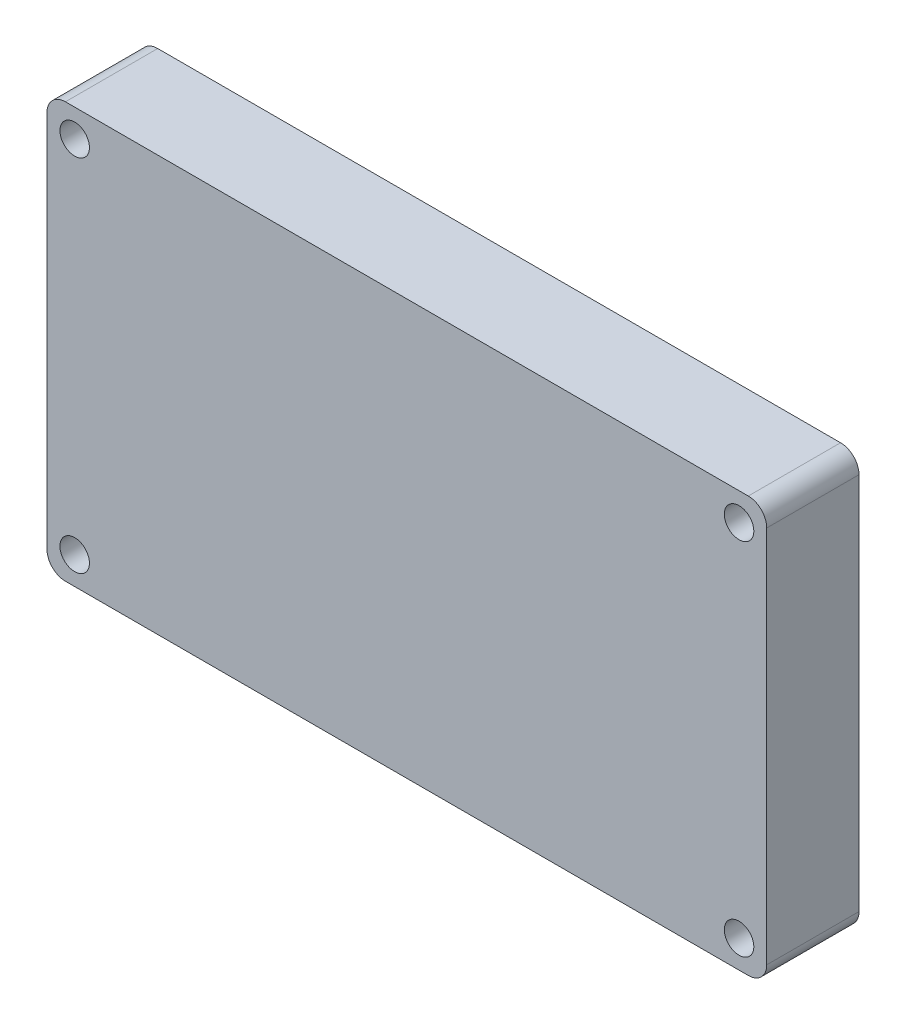
ISO-10303-21;
HEADER;
FILE_DESCRIPTION(('STEP AP214'),'2;1');
FILE_NAME('part.step','',(''),(''),'','','');
FILE_SCHEMA(('AUTOMOTIVE_DESIGN { 1 0 10303 214 1 1 1 1 }'));
ENDSEC;
DATA;
#1=APPLICATION_CONTEXT('core data for automotive mechanical design processes');
#2=APPLICATION_PROTOCOL_DEFINITION('international standard','automotive_design',2000,#1);
#3=PRODUCT_CONTEXT('',#1,'mechanical');
#4=PRODUCT('Part','Part','',(#3));
#5=PRODUCT_RELATED_PRODUCT_CATEGORY('part','',(#4));
#6=PRODUCT_DEFINITION_FORMATION('','',#4);
#7=PRODUCT_DEFINITION_CONTEXT('part definition',#1,'design');
#8=PRODUCT_DEFINITION('design','',#6,#7);
#9=PRODUCT_DEFINITION_SHAPE('','',#8);
#10=(LENGTH_UNIT() NAMED_UNIT(*) SI_UNIT(.MILLI.,.METRE.));
#11=(NAMED_UNIT(*) PLANE_ANGLE_UNIT() SI_UNIT($,.RADIAN.));
#12=(NAMED_UNIT(*) SI_UNIT($,.STERADIAN.) SOLID_ANGLE_UNIT());
#13=UNCERTAINTY_MEASURE_WITH_UNIT(LENGTH_MEASURE(1.E-05),#10,'distance_accuracy_value','');
#14=(GEOMETRIC_REPRESENTATION_CONTEXT(3) GLOBAL_UNCERTAINTY_ASSIGNED_CONTEXT((#13)) GLOBAL_UNIT_ASSIGNED_CONTEXT((#10,
#11,#12)) REPRESENTATION_CONTEXT('',''));
#15=CARTESIAN_POINT('',(0.,0.,0.));
#16=DIRECTION('',(0.,0.,1.));
#17=DIRECTION('',(1.,0.,0.));
#18=AXIS2_PLACEMENT_3D('',#15,#16,#17);
#19=CARTESIAN_POINT('',(-2.,2.,10.));
#20=DIRECTION('',(0.,0.,-1.));
#21=DIRECTION('',(-1.,0.,0.));
#22=AXIS2_PLACEMENT_3D('',#19,#20,#21);
#23=PLANE('',#22);
#24=CARTESIAN_POINT('',(-2.,2.,10.));
#25=DIRECTION('',(0.,0.,1.));
#26=DIRECTION('',(-1.,0.,0.));
#27=AXIS2_PLACEMENT_3D('',#24,#25,#26);
#28=CIRCLE('',#27,2.);
#29=CARTESIAN_POINT('',(-2.00000000000001,0.,10.));
#30=VERTEX_POINT('',#29);
#31=CARTESIAN_POINT('',(0.,2.00000000000001,10.));
#32=VERTEX_POINT('',#31);
#33=EDGE_CURVE('E166',#30,#32,#28,.T.);
#34=ORIENTED_EDGE('',*,*,#33,.T.);
#35=DIRECTION('',(0.,1.,0.));
#36=VECTOR('',#35,1.);
#37=CARTESIAN_POINT('',(0.,2.00000000000001,10.));
#38=LINE('',#37,#36);
#39=CARTESIAN_POINT('',(0.,43.,10.));
#40=VERTEX_POINT('',#39);
#41=EDGE_CURVE('E99',#32,#40,#38,.T.);
#42=ORIENTED_EDGE('',*,*,#41,.T.);
#43=CARTESIAN_POINT('',(-2.,43.,10.));
#44=DIRECTION('',(0.,0.,1.));
#45=DIRECTION('',(-1.,0.,0.));
#46=AXIS2_PLACEMENT_3D('',#43,#44,#45);
#47=CIRCLE('',#46,2.);
#48=CARTESIAN_POINT('',(-2.00000000000001,45.,10.));
#49=VERTEX_POINT('',#48);
#50=EDGE_CURVE('E177',#40,#49,#47,.T.);
#51=ORIENTED_EDGE('',*,*,#50,.T.);
#52=DIRECTION('',(-1.,0.,0.));
#53=VECTOR('',#52,1.);
#54=CARTESIAN_POINT('',(-2.00000000000001,45.,10.));
#55=LINE('',#54,#53);
#56=CARTESIAN_POINT('',(-76.,45.,10.));
#57=VERTEX_POINT('',#56);
#58=EDGE_CURVE('E180',#49,#57,#55,.T.);
#59=ORIENTED_EDGE('',*,*,#58,.T.);
#60=CARTESIAN_POINT('',(-76.,43.,10.));
#61=DIRECTION('',(0.,0.,1.));
#62=DIRECTION('',(1.,0.,0.));
#63=AXIS2_PLACEMENT_3D('',#60,#61,#62);
#64=CIRCLE('',#63,2.);
#65=CARTESIAN_POINT('',(-78.,43.,10.));
#66=VERTEX_POINT('',#65);
#67=EDGE_CURVE('E119',#57,#66,#64,.T.);
#68=ORIENTED_EDGE('',*,*,#67,.T.);
#69=DIRECTION('',(0.,-1.,0.));
#70=VECTOR('',#69,1.);
#71=CARTESIAN_POINT('',(-78.,42.,10.));
#72=LINE('',#71,#70);
#73=CARTESIAN_POINT('',(-78.,2.00000000000001,10.));
#74=VERTEX_POINT('',#73);
#75=EDGE_CURVE('E112',#66,#74,#72,.T.);
#76=ORIENTED_EDGE('',*,*,#75,.T.);
#77=CARTESIAN_POINT('',(-76.,2.,10.));
#78=DIRECTION('',(0.,0.,1.));
#79=DIRECTION('',(-1.,0.,0.));
#80=AXIS2_PLACEMENT_3D('',#77,#78,#79);
#81=CIRCLE('',#80,2.);
#82=CARTESIAN_POINT('',(-76.,0.,10.));
#83=VERTEX_POINT('',#82);
#84=EDGE_CURVE('E116',#74,#83,#81,.T.);
#85=ORIENTED_EDGE('',*,*,#84,.T.);
#86=DIRECTION('',(1.,0.,0.));
#87=VECTOR('',#86,1.);
#88=CARTESIAN_POINT('',(-75.,0.,10.));
#89=LINE('',#88,#87);
#90=EDGE_CURVE('E58',#83,#30,#89,.T.);
#91=ORIENTED_EDGE('',*,*,#90,.T.);
#92=EDGE_LOOP('',(#34,#42,#51,#59,#68,#76,#85,#91));
#93=FACE_BOUND('',#92,.T.);
#94=CARTESIAN_POINT('',(-75.,3.,10.));
#95=DIRECTION('',(0.,0.,1.));
#96=DIRECTION('',(1.,0.,0.));
#97=AXIS2_PLACEMENT_3D('',#94,#95,#96);
#98=CIRCLE('',#97,1.60000000000001);
#99=CARTESIAN_POINT('',(-73.4,3.,10.));
#100=VERTEX_POINT('',#99);
#101=EDGE_CURVE('E153',#100,#100,#98,.T.);
#102=ORIENTED_EDGE('',*,*,#101,.F.);
#103=EDGE_LOOP('',(#102));
#104=FACE_BOUND('',#103,.T.);
#105=CARTESIAN_POINT('',(-3.,3.,10.));
#106=DIRECTION('',(0.,0.,1.));
#107=DIRECTION('',(1.,0.,0.));
#108=AXIS2_PLACEMENT_3D('',#105,#106,#107);
#109=CIRCLE('',#108,1.6);
#110=CARTESIAN_POINT('',(-1.4,3.,10.));
#111=VERTEX_POINT('',#110);
#112=EDGE_CURVE('E165',#111,#111,#109,.T.);
#113=ORIENTED_EDGE('',*,*,#112,.F.);
#114=EDGE_LOOP('',(#113));
#115=FACE_BOUND('',#114,.T.);
#116=CARTESIAN_POINT('',(-3.,42.,10.));
#117=DIRECTION('',(0.,0.,1.));
#118=DIRECTION('',(1.,0.,0.));
#119=AXIS2_PLACEMENT_3D('',#116,#117,#118);
#120=CIRCLE('',#119,1.6);
#121=CARTESIAN_POINT('',(-1.4,42.,10.));
#122=VERTEX_POINT('',#121);
#123=EDGE_CURVE('E214',#122,#122,#120,.T.);
#124=ORIENTED_EDGE('',*,*,#123,.F.);
#125=EDGE_LOOP('',(#124));
#126=FACE_BOUND('',#125,.T.);
#127=CARTESIAN_POINT('',(-75.,42.,10.));
#128=DIRECTION('',(0.,0.,1.));
#129=DIRECTION('',(-1.,0.,0.));
#130=AXIS2_PLACEMENT_3D('',#127,#128,#129);
#131=CIRCLE('',#130,1.60000000000001);
#132=CARTESIAN_POINT('',(-76.6,42.,10.));
#133=VERTEX_POINT('',#132);
#134=EDGE_CURVE('E221',#133,#133,#131,.T.);
#135=ORIENTED_EDGE('',*,*,#134,.F.);
#136=EDGE_LOOP('',(#135));
#137=FACE_BOUND('',#136,.T.);
#138=ADVANCED_FACE('F40',(#93,#104,#115,#126,#137),#23,.F.);
#139=CARTESIAN_POINT('',(-2.,2.,0.));
#140=DIRECTION('',(0.,0.,-1.));
#141=DIRECTION('',(-1.,0.,0.));
#142=AXIS2_PLACEMENT_3D('',#139,#140,#141);
#143=PLANE('',#142);
#144=CARTESIAN_POINT('',(-3.,42.,0.));
#145=DIRECTION('',(0.,0.,1.));
#146=DIRECTION('',(1.,0.,0.));
#147=AXIS2_PLACEMENT_3D('',#144,#145,#146);
#148=CIRCLE('',#147,1.6);
#149=CARTESIAN_POINT('',(-1.4,42.,0.));
#150=VERTEX_POINT('',#149);
#151=EDGE_CURVE('E217',#150,#150,#148,.T.);
#152=ORIENTED_EDGE('',*,*,#151,.T.);
#153=EDGE_LOOP('',(#152));
#154=FACE_BOUND('',#153,.T.);
#155=CARTESIAN_POINT('',(-75.,3.,0.));
#156=DIRECTION('',(0.,0.,1.));
#157=DIRECTION('',(1.,0.,0.));
#158=AXIS2_PLACEMENT_3D('',#155,#156,#157);
#159=CIRCLE('',#158,1.60000000000001);
#160=CARTESIAN_POINT('',(-73.4,3.,0.));
#161=VERTEX_POINT('',#160);
#162=EDGE_CURVE('E160',#161,#161,#159,.T.);
#163=ORIENTED_EDGE('',*,*,#162,.T.);
#164=EDGE_LOOP('',(#163));
#165=FACE_BOUND('',#164,.T.);
#166=CARTESIAN_POINT('',(-2.,2.,0.));
#167=DIRECTION('',(0.,0.,1.));
#168=DIRECTION('',(-1.,0.,0.));
#169=AXIS2_PLACEMENT_3D('',#166,#167,#168);
#170=CIRCLE('',#169,2.);
#171=CARTESIAN_POINT('',(-2.00000000000001,0.,0.));
#172=VERTEX_POINT('',#171);
#173=CARTESIAN_POINT('',(0.,2.00000000000001,0.));
#174=VERTEX_POINT('',#173);
#175=EDGE_CURVE('E159',#172,#174,#170,.T.);
#176=ORIENTED_EDGE('',*,*,#175,.F.);
#177=DIRECTION('',(1.,0.,0.));
#178=VECTOR('',#177,1.);
#179=CARTESIAN_POINT('',(-3.00000000000002,0.,0.));
#180=LINE('',#179,#178);
#181=CARTESIAN_POINT('',(-76.,0.,0.));
#182=VERTEX_POINT('',#181);
#183=EDGE_CURVE('E87',#182,#172,#180,.T.);
#184=ORIENTED_EDGE('',*,*,#183,.F.);
#185=CARTESIAN_POINT('',(-76.,2.,0.));
#186=DIRECTION('',(0.,0.,1.));
#187=DIRECTION('',(-1.,0.,0.));
#188=AXIS2_PLACEMENT_3D('',#185,#186,#187);
#189=CIRCLE('',#188,2.);
#190=CARTESIAN_POINT('',(-78.,2.00000000000001,0.));
#191=VERTEX_POINT('',#190);
#192=EDGE_CURVE('E188',#191,#182,#189,.T.);
#193=ORIENTED_EDGE('',*,*,#192,.F.);
#194=DIRECTION('',(0.,-1.,0.));
#195=VECTOR('',#194,1.);
#196=CARTESIAN_POINT('',(-78.,2.00000000000001,0.));
#197=LINE('',#196,#195);
#198=CARTESIAN_POINT('',(-78.,43.,0.));
#199=VERTEX_POINT('',#198);
#200=EDGE_CURVE('E128',#199,#191,#197,.T.);
#201=ORIENTED_EDGE('',*,*,#200,.F.);
#202=CARTESIAN_POINT('',(-76.,43.,0.));
#203=DIRECTION('',(0.,0.,1.));
#204=DIRECTION('',(1.,0.,0.));
#205=AXIS2_PLACEMENT_3D('',#202,#203,#204);
#206=CIRCLE('',#205,2.);
#207=CARTESIAN_POINT('',(-76.,45.,0.));
#208=VERTEX_POINT('',#207);
#209=EDGE_CURVE('E193',#208,#199,#206,.T.);
#210=ORIENTED_EDGE('',*,*,#209,.F.);
#211=DIRECTION('',(-1.,0.,0.));
#212=VECTOR('',#211,1.);
#213=CARTESIAN_POINT('',(-76.,45.,0.));
#214=LINE('',#213,#212);
#215=CARTESIAN_POINT('',(-2.00000000000001,45.,0.));
#216=VERTEX_POINT('',#215);
#217=EDGE_CURVE('E197',#216,#208,#214,.T.);
#218=ORIENTED_EDGE('',*,*,#217,.F.);
#219=CARTESIAN_POINT('',(-2.,43.,0.));
#220=DIRECTION('',(0.,0.,1.));
#221=DIRECTION('',(-1.,0.,0.));
#222=AXIS2_PLACEMENT_3D('',#219,#220,#221);
#223=CIRCLE('',#222,2.);
#224=CARTESIAN_POINT('',(0.,43.,0.));
#225=VERTEX_POINT('',#224);
#226=EDGE_CURVE('E200',#225,#216,#223,.T.);
#227=ORIENTED_EDGE('',*,*,#226,.F.);
#228=DIRECTION('',(0.,1.,0.));
#229=VECTOR('',#228,1.);
#230=CARTESIAN_POINT('',(0.,42.,0.));
#231=LINE('',#230,#229);
#232=EDGE_CURVE('E204',#174,#225,#231,.T.);
#233=ORIENTED_EDGE('',*,*,#232,.F.);
#234=EDGE_LOOP('',(#176,#184,#193,#201,#210,#218,#227,#233));
#235=FACE_BOUND('',#234,.T.);
#236=CARTESIAN_POINT('',(-3.,3.,0.));
#237=DIRECTION('',(0.,0.,1.));
#238=DIRECTION('',(1.,0.,0.));
#239=AXIS2_PLACEMENT_3D('',#236,#237,#238);
#240=CIRCLE('',#239,1.6);
#241=CARTESIAN_POINT('',(-1.4,3.,0.));
#242=VERTEX_POINT('',#241);
#243=EDGE_CURVE('E161',#242,#242,#240,.T.);
#244=ORIENTED_EDGE('',*,*,#243,.T.);
#245=EDGE_LOOP('',(#244));
#246=FACE_BOUND('',#245,.T.);
#247=CARTESIAN_POINT('',(-75.,42.,0.));
#248=DIRECTION('',(0.,0.,1.));
#249=DIRECTION('',(-1.,0.,0.));
#250=AXIS2_PLACEMENT_3D('',#247,#248,#249);
#251=CIRCLE('',#250,1.60000000000001);
#252=CARTESIAN_POINT('',(-76.6,42.,0.));
#253=VERTEX_POINT('',#252);
#254=EDGE_CURVE('E225',#253,#253,#251,.T.);
#255=ORIENTED_EDGE('',*,*,#254,.T.);
#256=EDGE_LOOP('',(#255));
#257=FACE_BOUND('',#256,.T.);
#258=ADVANCED_FACE('F233',(#154,#165,#235,#246,#257),#143,.T.);
#259=CARTESIAN_POINT('',(-2.,2.,10.));
#260=DIRECTION('',(0.,0.,-1.));
#261=DIRECTION('',(-1.,0.,0.));
#262=AXIS2_PLACEMENT_3D('',#259,#260,#261);
#263=CYLINDRICAL_SURFACE('',#262,2.);
#264=ORIENTED_EDGE('',*,*,#175,.T.);
#265=DIRECTION('',(0.,0.,-1.));
#266=VECTOR('',#265,1.);
#267=CARTESIAN_POINT('',(0.,2.00000000000001,10.));
#268=LINE('',#267,#266);
#269=EDGE_CURVE('E12',#32,#174,#268,.T.);
#270=ORIENTED_EDGE('',*,*,#269,.F.);
#271=ORIENTED_EDGE('',*,*,#33,.F.);
#272=DIRECTION('',(0.,0.,-1.));
#273=VECTOR('',#272,1.);
#274=CARTESIAN_POINT('',(-2.00000000000001,0.,10.));
#275=LINE('',#274,#273);
#276=EDGE_CURVE('E138',#30,#172,#275,.T.);
#277=ORIENTED_EDGE('',*,*,#276,.T.);
#278=EDGE_LOOP('',(#264,#270,#271,#277));
#279=FACE_BOUND('',#278,.T.);
#280=ADVANCED_FACE('F42',(#279),#263,.T.);
#281=CARTESIAN_POINT('',(0.,42.,10.));
#282=DIRECTION('',(-1.,0.,0.));
#283=DIRECTION('',(0.,-1.,0.));
#284=AXIS2_PLACEMENT_3D('',#281,#282,#283);
#285=PLANE('',#284);
#286=ORIENTED_EDGE('',*,*,#232,.T.);
#287=DIRECTION('',(0.,0.,-1.));
#288=VECTOR('',#287,1.);
#289=CARTESIAN_POINT('',(0.,43.,10.));
#290=LINE('',#289,#288);
#291=EDGE_CURVE('E50',#40,#225,#290,.T.);
#292=ORIENTED_EDGE('',*,*,#291,.F.);
#293=ORIENTED_EDGE('',*,*,#41,.F.);
#294=ORIENTED_EDGE('',*,*,#269,.T.);
#295=EDGE_LOOP('',(#286,#292,#293,#294));
#296=FACE_BOUND('',#295,.T.);
#297=ADVANCED_FACE('F274',(#296),#285,.F.);
#298=CARTESIAN_POINT('',(-2.,43.,10.));
#299=DIRECTION('',(0.,0.,-1.));
#300=DIRECTION('',(-1.,0.,0.));
#301=AXIS2_PLACEMENT_3D('',#298,#299,#300);
#302=CYLINDRICAL_SURFACE('',#301,2.);
#303=ORIENTED_EDGE('',*,*,#226,.T.);
#304=DIRECTION('',(0.,0.,-1.));
#305=VECTOR('',#304,1.);
#306=CARTESIAN_POINT('',(-2.00000000000001,45.,10.));
#307=LINE('',#306,#305);
#308=EDGE_CURVE('E288',#49,#216,#307,.T.);
#309=ORIENTED_EDGE('',*,*,#308,.F.);
#310=ORIENTED_EDGE('',*,*,#50,.F.);
#311=ORIENTED_EDGE('',*,*,#291,.T.);
#312=EDGE_LOOP('',(#303,#309,#310,#311));
#313=FACE_BOUND('',#312,.T.);
#314=ADVANCED_FACE('F271',(#313),#302,.T.);
#315=CARTESIAN_POINT('',(-76.,45.,10.));
#316=DIRECTION('',(0.,-1.,0.));
#317=DIRECTION('',(0.,0.,-1.));
#318=AXIS2_PLACEMENT_3D('',#315,#316,#317);
#319=PLANE('',#318);
#320=ORIENTED_EDGE('',*,*,#217,.T.);
#321=DIRECTION('',(0.,0.,-1.));
#322=VECTOR('',#321,1.);
#323=CARTESIAN_POINT('',(-76.,45.,10.));
#324=LINE('',#323,#322);
#325=EDGE_CURVE('E294',#57,#208,#324,.T.);
#326=ORIENTED_EDGE('',*,*,#325,.F.);
#327=ORIENTED_EDGE('',*,*,#58,.F.);
#328=ORIENTED_EDGE('',*,*,#308,.T.);
#329=EDGE_LOOP('',(#320,#326,#327,#328));
#330=FACE_BOUND('',#329,.T.);
#331=ADVANCED_FACE('F267',(#330),#319,.F.);
#332=CARTESIAN_POINT('',(-76.,43.,10.));
#333=DIRECTION('',(0.,0.,-1.));
#334=DIRECTION('',(-1.,0.,0.));
#335=AXIS2_PLACEMENT_3D('',#332,#333,#334);
#336=CYLINDRICAL_SURFACE('',#335,2.);
#337=ORIENTED_EDGE('',*,*,#209,.T.);
#338=DIRECTION('',(0.,0.,-1.));
#339=VECTOR('',#338,1.);
#340=CARTESIAN_POINT('',(-78.,43.,10.));
#341=LINE('',#340,#339);
#342=EDGE_CURVE('E131',#66,#199,#341,.T.);
#343=ORIENTED_EDGE('',*,*,#342,.F.);
#344=ORIENTED_EDGE('',*,*,#67,.F.);
#345=ORIENTED_EDGE('',*,*,#325,.T.);
#346=EDGE_LOOP('',(#337,#343,#344,#345));
#347=FACE_BOUND('',#346,.T.);
#348=ADVANCED_FACE('F264',(#347),#336,.T.);
#349=CARTESIAN_POINT('',(-78.,2.00000000000001,10.));
#350=DIRECTION('',(1.,0.,0.));
#351=DIRECTION('',(0.,0.,-1.));
#352=AXIS2_PLACEMENT_3D('',#349,#350,#351);
#353=PLANE('',#352);
#354=ORIENTED_EDGE('',*,*,#200,.T.);
#355=DIRECTION('',(0.,0.,-1.));
#356=VECTOR('',#355,1.);
#357=CARTESIAN_POINT('',(-78.,2.00000000000001,10.));
#358=LINE('',#357,#356);
#359=EDGE_CURVE('E126',#74,#191,#358,.T.);
#360=ORIENTED_EDGE('',*,*,#359,.F.);
#361=ORIENTED_EDGE('',*,*,#75,.F.);
#362=ORIENTED_EDGE('',*,*,#342,.T.);
#363=EDGE_LOOP('',(#354,#360,#361,#362));
#364=FACE_BOUND('',#363,.T.);
#365=ADVANCED_FACE('F127',(#364),#353,.F.);
#366=CARTESIAN_POINT('',(-76.,2.,10.));
#367=DIRECTION('',(0.,0.,-1.));
#368=DIRECTION('',(-1.,0.,0.));
#369=AXIS2_PLACEMENT_3D('',#366,#367,#368);
#370=CYLINDRICAL_SURFACE('',#369,2.);
#371=ORIENTED_EDGE('',*,*,#192,.T.);
#372=DIRECTION('',(0.,0.,-1.));
#373=VECTOR('',#372,1.);
#374=CARTESIAN_POINT('',(-76.,0.,10.));
#375=LINE('',#374,#373);
#376=EDGE_CURVE('E132',#83,#182,#375,.T.);
#377=ORIENTED_EDGE('',*,*,#376,.F.);
#378=ORIENTED_EDGE('',*,*,#84,.F.);
#379=ORIENTED_EDGE('',*,*,#359,.T.);
#380=EDGE_LOOP('',(#371,#377,#378,#379));
#381=FACE_BOUND('',#380,.T.);
#382=ADVANCED_FACE('F134',(#381),#370,.T.);
#383=CARTESIAN_POINT('',(-3.00000000000002,0.,10.));
#384=DIRECTION('',(0.,1.,0.));
#385=DIRECTION('',(0.,0.,1.));
#386=AXIS2_PLACEMENT_3D('',#383,#384,#385);
#387=PLANE('',#386);
#388=ORIENTED_EDGE('',*,*,#183,.T.);
#389=ORIENTED_EDGE('',*,*,#276,.F.);
#390=ORIENTED_EDGE('',*,*,#90,.F.);
#391=ORIENTED_EDGE('',*,*,#376,.T.);
#392=EDGE_LOOP('',(#388,#389,#390,#391));
#393=FACE_BOUND('',#392,.T.);
#394=ADVANCED_FACE('F257',(#393),#387,.F.);
#395=CARTESIAN_POINT('',(-75.,3.,10.));
#396=DIRECTION('',(0.,0.,-1.));
#397=DIRECTION('',(-1.,0.,0.));
#398=AXIS2_PLACEMENT_3D('',#395,#396,#397);
#399=CYLINDRICAL_SURFACE('',#398,1.60000000000001);
#400=ORIENTED_EDGE('',*,*,#101,.T.);
#401=EDGE_LOOP('',(#400));
#402=FACE_BOUND('',#401,.T.);
#403=ORIENTED_EDGE('',*,*,#162,.F.);
#404=EDGE_LOOP('',(#403));
#405=FACE_BOUND('',#404,.T.);
#406=ADVANCED_FACE('F254',(#402,#405),#399,.F.);
#407=CARTESIAN_POINT('',(-3.,3.,10.));
#408=DIRECTION('',(0.,0.,-1.));
#409=DIRECTION('',(-1.,0.,0.));
#410=AXIS2_PLACEMENT_3D('',#407,#408,#409);
#411=CYLINDRICAL_SURFACE('',#410,1.6);
#412=ORIENTED_EDGE('',*,*,#112,.T.);
#413=EDGE_LOOP('',(#412));
#414=FACE_BOUND('',#413,.T.);
#415=ORIENTED_EDGE('',*,*,#243,.F.);
#416=EDGE_LOOP('',(#415));
#417=FACE_BOUND('',#416,.T.);
#418=ADVANCED_FACE('F243',(#414,#417),#411,.F.);
#419=CARTESIAN_POINT('',(-3.,42.,10.));
#420=DIRECTION('',(0.,0.,-1.));
#421=DIRECTION('',(-1.,0.,0.));
#422=AXIS2_PLACEMENT_3D('',#419,#420,#421);
#423=CYLINDRICAL_SURFACE('',#422,1.6);
#424=ORIENTED_EDGE('',*,*,#123,.T.);
#425=EDGE_LOOP('',(#424));
#426=FACE_BOUND('',#425,.T.);
#427=ORIENTED_EDGE('',*,*,#151,.F.);
#428=EDGE_LOOP('',(#427));
#429=FACE_BOUND('',#428,.T.);
#430=ADVANCED_FACE('F237',(#426,#429),#423,.F.);
#431=CARTESIAN_POINT('',(-75.,42.,10.));
#432=DIRECTION('',(0.,0.,-1.));
#433=DIRECTION('',(-1.,0.,0.));
#434=AXIS2_PLACEMENT_3D('',#431,#432,#433);
#435=CYLINDRICAL_SURFACE('',#434,1.60000000000001);
#436=ORIENTED_EDGE('',*,*,#134,.T.);
#437=EDGE_LOOP('',(#436));
#438=FACE_BOUND('',#437,.T.);
#439=ORIENTED_EDGE('',*,*,#254,.F.);
#440=EDGE_LOOP('',(#439));
#441=FACE_BOUND('',#440,.T.);
#442=ADVANCED_FACE('F235',(#438,#441),#435,.F.);
#443=CLOSED_SHELL('',(#138,#258,#280,#297,#314,#331,#348,#365,#382,#394,#406,#418,#430,#442));
#444=MANIFOLD_SOLID_BREP('B2',#443);
#445=ADVANCED_BREP_SHAPE_REPRESENTATION('',(#18,#444),#14);
#446=SHAPE_DEFINITION_REPRESENTATION(#9,#445);
ENDSEC;
END-ISO-10303-21;
